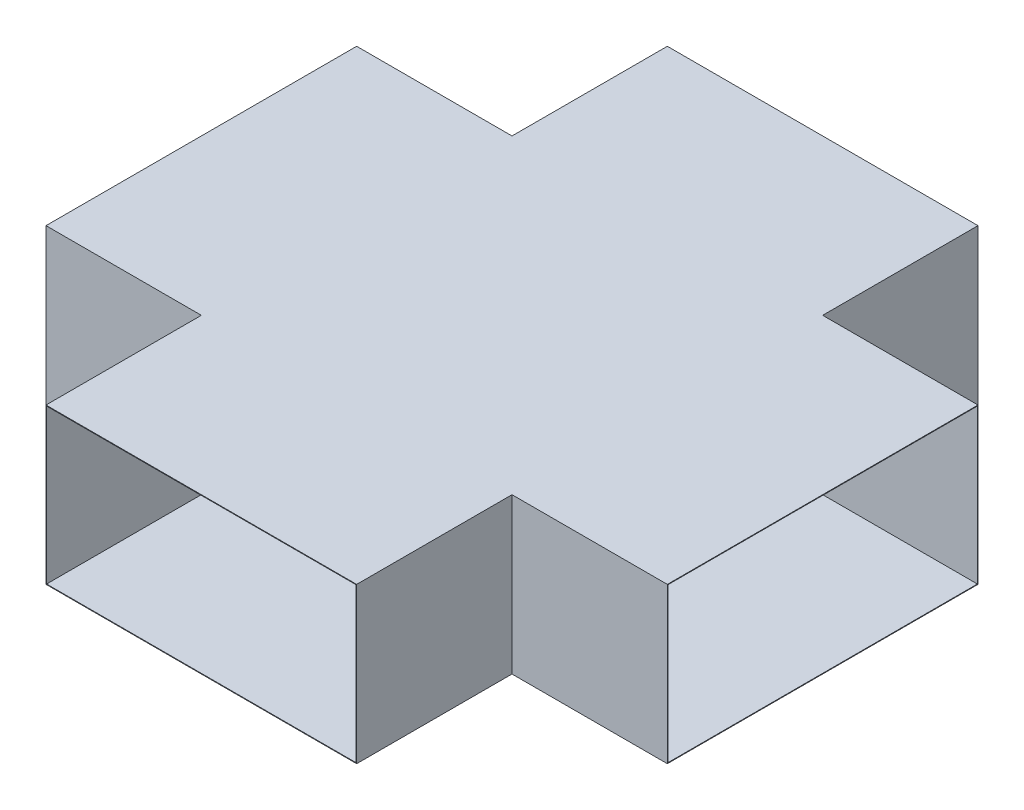
ISO-10303-21;
HEADER;
FILE_DESCRIPTION(('STEP AP214'),'2;1');
FILE_NAME('part.step','',(''),(''),'','','');
FILE_SCHEMA(('AUTOMOTIVE_DESIGN { 1 0 10303 214 1 1 1 1 }'));
ENDSEC;
DATA;
#1=APPLICATION_CONTEXT('core data for automotive mechanical design processes');
#2=APPLICATION_PROTOCOL_DEFINITION('international standard','automotive_design',2000,#1);
#3=PRODUCT_CONTEXT('',#1,'mechanical');
#4=PRODUCT('Part','Part','',(#3));
#5=PRODUCT_RELATED_PRODUCT_CATEGORY('part','',(#4));
#6=PRODUCT_DEFINITION_FORMATION('','',#4);
#7=PRODUCT_DEFINITION_CONTEXT('part definition',#1,'design');
#8=PRODUCT_DEFINITION('design','',#6,#7);
#9=PRODUCT_DEFINITION_SHAPE('','',#8);
#10=(LENGTH_UNIT() NAMED_UNIT(*) SI_UNIT(.MILLI.,.METRE.));
#11=(NAMED_UNIT(*) PLANE_ANGLE_UNIT() SI_UNIT($,.RADIAN.));
#12=(NAMED_UNIT(*) SI_UNIT($,.STERADIAN.) SOLID_ANGLE_UNIT());
#13=UNCERTAINTY_MEASURE_WITH_UNIT(LENGTH_MEASURE(1.E-05),#10,'distance_accuracy_value','');
#14=(GEOMETRIC_REPRESENTATION_CONTEXT(3) GLOBAL_UNCERTAINTY_ASSIGNED_CONTEXT((#13)) GLOBAL_UNIT_ASSIGNED_CONTEXT((#10,
#11,#12)) REPRESENTATION_CONTEXT('',''));
#15=CARTESIAN_POINT('',(0.,0.,0.));
#16=DIRECTION('',(0.,0.,1.));
#17=DIRECTION('',(1.,0.,0.));
#18=AXIS2_PLACEMENT_3D('',#15,#16,#17);
#19=CARTESIAN_POINT('',(1000.,250.,-498.));
#20=DIRECTION('',(0.,0.,1.));
#21=DIRECTION('',(0.,-1.,0.));
#22=AXIS2_PLACEMENT_3D('',#19,#20,#21);
#23=PLANE('',#22);
#24=DIRECTION('',(0.,-1.,0.));
#25=VECTOR('',#24,1.);
#26=CARTESIAN_POINT('',(498.,248.,-498.));
#27=LINE('',#26,#25);
#28=CARTESIAN_POINT('',(498.,248.,-498.));
#29=VERTEX_POINT('',#28);
#30=CARTESIAN_POINT('',(498.,-248.,-498.));
#31=VERTEX_POINT('',#30);
#32=EDGE_CURVE('E271',#29,#31,#27,.T.);
#33=ORIENTED_EDGE('',*,*,#32,.T.);
#34=DIRECTION('',(-1.,0.,0.));
#35=VECTOR('',#34,1.);
#36=CARTESIAN_POINT('',(1000.,-248.,-498.));
#37=LINE('',#36,#35);
#38=CARTESIAN_POINT('',(1000.,-248.,-498.));
#39=VERTEX_POINT('',#38);
#40=EDGE_CURVE('E283',#39,#31,#37,.T.);
#41=ORIENTED_EDGE('',*,*,#40,.F.);
#42=DIRECTION('',(0.,1.,0.));
#43=VECTOR('',#42,1.);
#44=CARTESIAN_POINT('',(1000.,250.,-498.));
#45=LINE('',#44,#43);
#46=CARTESIAN_POINT('',(1000.,248.,-498.));
#47=VERTEX_POINT('',#46);
#48=EDGE_CURVE('E506',#39,#47,#45,.T.);
#49=ORIENTED_EDGE('',*,*,#48,.T.);
#50=DIRECTION('',(-1.,0.,0.));
#51=VECTOR('',#50,1.);
#52=CARTESIAN_POINT('',(1000.,248.,-498.));
#53=LINE('',#52,#51);
#54=EDGE_CURVE('E285',#47,#29,#53,.T.);
#55=ORIENTED_EDGE('',*,*,#54,.T.);
#56=EDGE_LOOP('',(#33,#41,#49,#55));
#57=FACE_BOUND('',#56,.T.);
#58=ADVANCED_FACE('F106',(#57),#23,.T.);
#59=CARTESIAN_POINT('',(1000.,250.,-500.));
#60=DIRECTION('',(0.,0.,1.));
#61=DIRECTION('',(0.,-1.,0.));
#62=AXIS2_PLACEMENT_3D('',#59,#60,#61);
#63=PLANE('',#62);
#64=DIRECTION('',(0.,1.,0.));
#65=VECTOR('',#64,1.);
#66=CARTESIAN_POINT('',(-500.,-250.,-500.));
#67=LINE('',#66,#65);
#68=CARTESIAN_POINT('',(-500.,-250.,-500.));
#69=VERTEX_POINT('',#68);
#70=CARTESIAN_POINT('',(-500.,250.,-500.));
#71=VERTEX_POINT('',#70);
#72=EDGE_CURVE('E131',#69,#71,#67,.T.);
#73=ORIENTED_EDGE('',*,*,#72,.F.);
#74=DIRECTION('',(-1.,0.,0.));
#75=VECTOR('',#74,1.);
#76=CARTESIAN_POINT('',(1000.,-250.,-500.));
#77=LINE('',#76,#75);
#78=CARTESIAN_POINT('',(-1000.,-250.,-500.));
#79=VERTEX_POINT('',#78);
#80=EDGE_CURVE('E343',#69,#79,#77,.T.);
#81=ORIENTED_EDGE('',*,*,#80,.T.);
#82=DIRECTION('',(0.,1.,0.));
#83=VECTOR('',#82,1.);
#84=CARTESIAN_POINT('',(-1000.,250.,-500.));
#85=LINE('',#84,#83);
#86=CARTESIAN_POINT('',(-1000.,250.,-500.));
#87=VERTEX_POINT('',#86);
#88=EDGE_CURVE('E319',#79,#87,#85,.T.);
#89=ORIENTED_EDGE('',*,*,#88,.T.);
#90=DIRECTION('',(-1.,0.,0.));
#91=VECTOR('',#90,1.);
#92=CARTESIAN_POINT('',(1000.,250.,-500.));
#93=LINE('',#92,#91);
#94=EDGE_CURVE('E335',#71,#87,#93,.T.);
#95=ORIENTED_EDGE('',*,*,#94,.F.);
#96=EDGE_LOOP('',(#73,#81,#89,#95));
#97=FACE_BOUND('',#96,.T.);
#98=ADVANCED_FACE('F530',(#97),#63,.F.);
#99=DIRECTION('',(0.,-1.,0.));
#100=VECTOR('',#99,1.);
#101=CARTESIAN_POINT('',(500.,-250.,-500.));
#102=LINE('',#101,#100);
#103=CARTESIAN_POINT('',(500.,250.,-500.));
#104=VERTEX_POINT('',#103);
#105=CARTESIAN_POINT('',(500.,-250.,-500.));
#106=VERTEX_POINT('',#105);
#107=EDGE_CURVE('E429',#104,#106,#102,.T.);
#108=ORIENTED_EDGE('',*,*,#107,.F.);
#109=CARTESIAN_POINT('',(1000.,250.,-500.));
#110=VERTEX_POINT('',#109);
#111=EDGE_CURVE('E348',#110,#104,#93,.T.);
#112=ORIENTED_EDGE('',*,*,#111,.F.);
#113=DIRECTION('',(0.,1.,0.));
#114=VECTOR('',#113,1.);
#115=CARTESIAN_POINT('',(1000.,250.,-500.));
#116=LINE('',#115,#114);
#117=CARTESIAN_POINT('',(1000.,-250.,-500.));
#118=VERTEX_POINT('',#117);
#119=EDGE_CURVE('E309',#118,#110,#116,.T.);
#120=ORIENTED_EDGE('',*,*,#119,.F.);
#121=EDGE_CURVE('E337',#118,#106,#77,.T.);
#122=ORIENTED_EDGE('',*,*,#121,.T.);
#123=EDGE_LOOP('',(#108,#112,#120,#122));
#124=FACE_BOUND('',#123,.T.);
#125=ADVANCED_FACE('F535',(#124),#63,.F.);
#126=CARTESIAN_POINT('',(1000.,250.,498.));
#127=DIRECTION('',(0.,0.,-1.));
#128=DIRECTION('',(0.,1.,0.));
#129=AXIS2_PLACEMENT_3D('',#126,#127,#128);
#130=PLANE('',#129);
#131=DIRECTION('',(-1.,0.,0.));
#132=VECTOR('',#131,1.);
#133=CARTESIAN_POINT('',(1000.,-248.,498.));
#134=LINE('',#133,#132);
#135=CARTESIAN_POINT('',(1000.,-248.,498.));
#136=VERTEX_POINT('',#135);
#137=CARTESIAN_POINT('',(498.,-248.,498.));
#138=VERTEX_POINT('',#137);
#139=EDGE_CURVE('E296',#136,#138,#134,.T.);
#140=ORIENTED_EDGE('',*,*,#139,.T.);
#141=DIRECTION('',(0.,-1.,0.));
#142=VECTOR('',#141,1.);
#143=CARTESIAN_POINT('',(498.,248.,498.));
#144=LINE('',#143,#142);
#145=CARTESIAN_POINT('',(498.,248.,498.));
#146=VERTEX_POINT('',#145);
#147=EDGE_CURVE('E418',#146,#138,#144,.T.);
#148=ORIENTED_EDGE('',*,*,#147,.F.);
#149=DIRECTION('',(-1.,0.,0.));
#150=VECTOR('',#149,1.);
#151=CARTESIAN_POINT('',(1000.,248.,498.));
#152=LINE('',#151,#150);
#153=CARTESIAN_POINT('',(1000.,248.,498.));
#154=VERTEX_POINT('',#153);
#155=EDGE_CURVE('E490',#154,#146,#152,.T.);
#156=ORIENTED_EDGE('',*,*,#155,.F.);
#157=DIRECTION('',(0.,-1.,0.));
#158=VECTOR('',#157,1.);
#159=CARTESIAN_POINT('',(1000.,250.,498.));
#160=LINE('',#159,#158);
#161=EDGE_CURVE('E372',#154,#136,#160,.T.);
#162=ORIENTED_EDGE('',*,*,#161,.T.);
#163=EDGE_LOOP('',(#140,#148,#156,#162));
#164=FACE_BOUND('',#163,.T.);
#165=ADVANCED_FACE('F509',(#164),#130,.T.);
#166=CARTESIAN_POINT('',(-498.,248.,498.));
#167=VERTEX_POINT('',#166);
#168=CARTESIAN_POINT('',(-1000.,248.,498.));
#169=VERTEX_POINT('',#168);
#170=EDGE_CURVE('E492',#167,#169,#152,.T.);
#171=ORIENTED_EDGE('',*,*,#170,.F.);
#172=DIRECTION('',(0.,1.,0.));
#173=VECTOR('',#172,1.);
#174=CARTESIAN_POINT('',(-498.,-248.,498.));
#175=LINE('',#174,#173);
#176=CARTESIAN_POINT('',(-498.,-248.,498.));
#177=VERTEX_POINT('',#176);
#178=EDGE_CURVE('E419',#177,#167,#175,.T.);
#179=ORIENTED_EDGE('',*,*,#178,.F.);
#180=CARTESIAN_POINT('',(-1000.,-248.,498.));
#181=VERTEX_POINT('',#180);
#182=EDGE_CURVE('E293',#177,#181,#134,.T.);
#183=ORIENTED_EDGE('',*,*,#182,.T.);
#184=DIRECTION('',(0.,-1.,0.));
#185=VECTOR('',#184,1.);
#186=CARTESIAN_POINT('',(-1000.,250.,498.));
#187=LINE('',#186,#185);
#188=EDGE_CURVE('E355',#169,#181,#187,.T.);
#189=ORIENTED_EDGE('',*,*,#188,.F.);
#190=EDGE_LOOP('',(#171,#179,#183,#189));
#191=FACE_BOUND('',#190,.T.);
#192=ADVANCED_FACE('F526',(#191),#130,.T.);
#193=CARTESIAN_POINT('',(1000.,250.,500.));
#194=DIRECTION('',(0.,0.,-1.));
#195=DIRECTION('',(0.,1.,0.));
#196=AXIS2_PLACEMENT_3D('',#193,#194,#195);
#197=PLANE('',#196);
#198=DIRECTION('',(-1.,0.,0.));
#199=VECTOR('',#198,1.);
#200=CARTESIAN_POINT('',(1000.,-250.,500.));
#201=LINE('',#200,#199);
#202=CARTESIAN_POINT('',(-500.,-250.,500.));
#203=VERTEX_POINT('',#202);
#204=CARTESIAN_POINT('',(-1000.,-250.,500.));
#205=VERTEX_POINT('',#204);
#206=EDGE_CURVE('E115',#203,#205,#201,.T.);
#207=ORIENTED_EDGE('',*,*,#206,.F.);
#208=DIRECTION('',(0.,1.,0.));
#209=VECTOR('',#208,1.);
#210=CARTESIAN_POINT('',(-500.,-250.,500.));
#211=LINE('',#210,#209);
#212=CARTESIAN_POINT('',(-499.999999999999,250.,500.));
#213=VERTEX_POINT('',#212);
#214=EDGE_CURVE('E357',#203,#213,#211,.T.);
#215=ORIENTED_EDGE('',*,*,#214,.T.);
#216=DIRECTION('',(-1.,0.,0.));
#217=VECTOR('',#216,1.);
#218=CARTESIAN_POINT('',(1000.,250.,500.));
#219=LINE('',#218,#217);
#220=CARTESIAN_POINT('',(-1000.,250.,500.));
#221=VERTEX_POINT('',#220);
#222=EDGE_CURVE('E313',#213,#221,#219,.T.);
#223=ORIENTED_EDGE('',*,*,#222,.T.);
#224=DIRECTION('',(0.,-1.,0.));
#225=VECTOR('',#224,1.);
#226=CARTESIAN_POINT('',(-1000.,250.,500.));
#227=LINE('',#226,#225);
#228=EDGE_CURVE('E302',#221,#205,#227,.T.);
#229=ORIENTED_EDGE('',*,*,#228,.T.);
#230=EDGE_LOOP('',(#207,#215,#223,#229));
#231=FACE_BOUND('',#230,.T.);
#232=ADVANCED_FACE('F517',(#231),#197,.F.);
#233=CARTESIAN_POINT('',(1000.,0.,0.));
#234=DIRECTION('',(1.,0.,0.));
#235=DIRECTION('',(0.,0.,-1.));
#236=AXIS2_PLACEMENT_3D('',#233,#234,#235);
#237=PLANE('',#236);
#238=DIRECTION('',(0.,-1.,0.));
#239=VECTOR('',#238,1.);
#240=CARTESIAN_POINT('',(1000.,250.,500.));
#241=LINE('',#240,#239);
#242=CARTESIAN_POINT('',(1000.,250.,500.));
#243=VERTEX_POINT('',#242);
#244=CARTESIAN_POINT('',(1000.,-250.,500.));
#245=VERTEX_POINT('',#244);
#246=EDGE_CURVE('E303',#243,#245,#241,.T.);
#247=ORIENTED_EDGE('',*,*,#246,.T.);
#248=DIRECTION('',(0.,0.,-1.));
#249=VECTOR('',#248,1.);
#250=CARTESIAN_POINT('',(1000.,-250.,500.));
#251=LINE('',#250,#249);
#252=EDGE_CURVE('E306',#245,#118,#251,.T.);
#253=ORIENTED_EDGE('',*,*,#252,.T.);
#254=ORIENTED_EDGE('',*,*,#119,.T.);
#255=DIRECTION('',(0.,0.,1.));
#256=VECTOR('',#255,1.);
#257=CARTESIAN_POINT('',(1000.,250.,500.));
#258=LINE('',#257,#256);
#259=EDGE_CURVE('E311',#110,#243,#258,.T.);
#260=ORIENTED_EDGE('',*,*,#259,.T.);
#261=EDGE_LOOP('',(#247,#253,#254,#260));
#262=FACE_BOUND('',#261,.T.);
#263=DIRECTION('',(0.,0.,-1.));
#264=VECTOR('',#263,1.);
#265=CARTESIAN_POINT('',(1000.,-248.,500.));
#266=LINE('',#265,#264);
#267=EDGE_CURVE('E292',#136,#39,#266,.T.);
#268=ORIENTED_EDGE('',*,*,#267,.F.);
#269=ORIENTED_EDGE('',*,*,#161,.F.);
#270=DIRECTION('',(0.,0.,1.));
#271=VECTOR('',#270,1.);
#272=CARTESIAN_POINT('',(1000.,248.,500.));
#273=LINE('',#272,#271);
#274=EDGE_CURVE('E495',#47,#154,#273,.T.);
#275=ORIENTED_EDGE('',*,*,#274,.F.);
#276=ORIENTED_EDGE('',*,*,#48,.F.);
#277=EDGE_LOOP('',(#268,#269,#275,#276));
#278=FACE_BOUND('',#277,.T.);
#279=ADVANCED_FACE('F514',(#262,#278),#237,.T.);
#280=CARTESIAN_POINT('',(-1000.,0.,0.));
#281=DIRECTION('',(1.,0.,0.));
#282=DIRECTION('',(0.,0.,-1.));
#283=AXIS2_PLACEMENT_3D('',#280,#281,#282);
#284=PLANE('',#283);
#285=ORIENTED_EDGE('',*,*,#228,.F.);
#286=DIRECTION('',(0.,0.,1.));
#287=VECTOR('',#286,1.);
#288=CARTESIAN_POINT('',(-1000.,250.,500.));
#289=LINE('',#288,#287);
#290=EDGE_CURVE('E307',#87,#221,#289,.T.);
#291=ORIENTED_EDGE('',*,*,#290,.F.);
#292=ORIENTED_EDGE('',*,*,#88,.F.);
#293=DIRECTION('',(0.,0.,-1.));
#294=VECTOR('',#293,1.);
#295=CARTESIAN_POINT('',(-1000.,-250.,500.));
#296=LINE('',#295,#294);
#297=EDGE_CURVE('E316',#205,#79,#296,.T.);
#298=ORIENTED_EDGE('',*,*,#297,.F.);
#299=EDGE_LOOP('',(#285,#291,#292,#298));
#300=FACE_BOUND('',#299,.T.);
#301=ORIENTED_EDGE('',*,*,#188,.T.);
#302=DIRECTION('',(0.,0.,-1.));
#303=VECTOR('',#302,1.);
#304=CARTESIAN_POINT('',(-1000.,-248.,500.));
#305=LINE('',#304,#303);
#306=CARTESIAN_POINT('',(-1000.,-248.,-498.));
#307=VERTEX_POINT('',#306);
#308=EDGE_CURVE('E500',#181,#307,#305,.T.);
#309=ORIENTED_EDGE('',*,*,#308,.T.);
#310=DIRECTION('',(0.,1.,0.));
#311=VECTOR('',#310,1.);
#312=CARTESIAN_POINT('',(-1000.,250.,-498.));
#313=LINE('',#312,#311);
#314=CARTESIAN_POINT('',(-1000.,248.,-498.));
#315=VERTEX_POINT('',#314);
#316=EDGE_CURVE('E498',#307,#315,#313,.T.);
#317=ORIENTED_EDGE('',*,*,#316,.T.);
#318=DIRECTION('',(0.,0.,1.));
#319=VECTOR('',#318,1.);
#320=CARTESIAN_POINT('',(-1000.,248.,500.));
#321=LINE('',#320,#319);
#322=EDGE_CURVE('E488',#315,#169,#321,.T.);
#323=ORIENTED_EDGE('',*,*,#322,.T.);
#324=EDGE_LOOP('',(#301,#309,#317,#323));
#325=FACE_BOUND('',#324,.T.);
#326=ADVANCED_FACE('F516',(#300,#325),#284,.F.);
#327=CARTESIAN_POINT('',(500.,250.,500.));
#328=VERTEX_POINT('',#327);
#329=EDGE_CURVE('E332',#243,#328,#219,.T.);
#330=ORIENTED_EDGE('',*,*,#329,.T.);
#331=DIRECTION('',(0.,-1.,0.));
#332=VECTOR('',#331,1.);
#333=CARTESIAN_POINT('',(500.,-250.,500.));
#334=LINE('',#333,#332);
#335=CARTESIAN_POINT('',(500.,-250.,500.));
#336=VERTEX_POINT('',#335);
#337=EDGE_CURVE('E361',#328,#336,#334,.T.);
#338=ORIENTED_EDGE('',*,*,#337,.T.);
#339=EDGE_CURVE('E12',#245,#336,#201,.T.);
#340=ORIENTED_EDGE('',*,*,#339,.F.);
#341=ORIENTED_EDGE('',*,*,#246,.F.);
#342=EDGE_LOOP('',(#330,#338,#340,#341));
#343=FACE_BOUND('',#342,.T.);
#344=ADVANCED_FACE('F108',(#343),#197,.F.);
#345=CARTESIAN_POINT('',(1000.,-250.,500.));
#346=DIRECTION('',(0.,1.,0.));
#347=DIRECTION('',(0.,0.,1.));
#348=AXIS2_PLACEMENT_3D('',#345,#346,#347);
#349=PLANE('',#348);
#350=ORIENTED_EDGE('',*,*,#297,.T.);
#351=ORIENTED_EDGE('',*,*,#80,.F.);
#352=DIRECTION('',(0.,0.,1.));
#353=VECTOR('',#352,1.);
#354=CARTESIAN_POINT('',(-500.,-250.,-1000.));
#355=LINE('',#354,#353);
#356=CARTESIAN_POINT('',(-500.,-250.,-1000.));
#357=VERTEX_POINT('',#356);
#358=EDGE_CURVE('E437',#357,#69,#355,.T.);
#359=ORIENTED_EDGE('',*,*,#358,.F.);
#360=DIRECTION('',(-1.,0.,0.));
#361=VECTOR('',#360,1.);
#362=CARTESIAN_POINT('',(-500.,-250.,-1000.));
#363=LINE('',#362,#361);
#364=CARTESIAN_POINT('',(500.,-250.,-1000.));
#365=VERTEX_POINT('',#364);
#366=EDGE_CURVE('E458',#365,#357,#363,.T.);
#367=ORIENTED_EDGE('',*,*,#366,.F.);
#368=DIRECTION('',(0.,0.,1.));
#369=VECTOR('',#368,1.);
#370=CARTESIAN_POINT('',(500.,-250.,-1000.));
#371=LINE('',#370,#369);
#372=EDGE_CURVE('E433',#365,#106,#371,.T.);
#373=ORIENTED_EDGE('',*,*,#372,.T.);
#374=ORIENTED_EDGE('',*,*,#121,.F.);
#375=ORIENTED_EDGE('',*,*,#252,.F.);
#376=ORIENTED_EDGE('',*,*,#339,.T.);
#377=DIRECTION('',(0.,0.,-1.));
#378=VECTOR('',#377,1.);
#379=CARTESIAN_POINT('',(500.,-250.,1000.));
#380=LINE('',#379,#378);
#381=CARTESIAN_POINT('',(500.,-250.,1000.));
#382=VERTEX_POINT('',#381);
#383=EDGE_CURVE('E356',#382,#336,#380,.T.);
#384=ORIENTED_EDGE('',*,*,#383,.F.);
#385=DIRECTION('',(-1.,0.,0.));
#386=VECTOR('',#385,1.);
#387=CARTESIAN_POINT('',(-500.,-250.,1000.));
#388=LINE('',#387,#386);
#389=CARTESIAN_POINT('',(-500.,-250.,1000.));
#390=VERTEX_POINT('',#389);
#391=EDGE_CURVE('E368',#382,#390,#388,.T.);
#392=ORIENTED_EDGE('',*,*,#391,.T.);
#393=DIRECTION('',(0.,0.,-1.));
#394=VECTOR('',#393,1.);
#395=CARTESIAN_POINT('',(-500.,-250.,1000.));
#396=LINE('',#395,#394);
#397=EDGE_CURVE('E353',#390,#203,#396,.T.);
#398=ORIENTED_EDGE('',*,*,#397,.T.);
#399=ORIENTED_EDGE('',*,*,#206,.T.);
#400=EDGE_LOOP('',(#350,#351,#359,#367,#373,#374,#375,#376,#384,#392,#398,#399));
#401=FACE_BOUND('',#400,.T.);
#402=ADVANCED_FACE('F549',(#401),#349,.F.);
#403=CARTESIAN_POINT('',(1000.,250.,500.));
#404=DIRECTION('',(0.,-1.,0.));
#405=DIRECTION('',(0.,0.,-1.));
#406=AXIS2_PLACEMENT_3D('',#403,#404,#405);
#407=PLANE('',#406);
#408=ORIENTED_EDGE('',*,*,#290,.T.);
#409=ORIENTED_EDGE('',*,*,#222,.F.);
#410=DIRECTION('',(0.,0.,-1.));
#411=VECTOR('',#410,1.);
#412=CARTESIAN_POINT('',(-499.999999999999,250.,1000.));
#413=LINE('',#412,#411);
#414=CARTESIAN_POINT('',(-499.999999999999,250.,1000.));
#415=VERTEX_POINT('',#414);
#416=EDGE_CURVE('E382',#415,#213,#413,.T.);
#417=ORIENTED_EDGE('',*,*,#416,.F.);
#418=DIRECTION('',(1.,0.,0.));
#419=VECTOR('',#418,1.);
#420=CARTESIAN_POINT('',(-499.999999999999,250.,1000.));
#421=LINE('',#420,#419);
#422=CARTESIAN_POINT('',(500.,250.,1000.));
#423=VERTEX_POINT('',#422);
#424=EDGE_CURVE('E392',#415,#423,#421,.T.);
#425=ORIENTED_EDGE('',*,*,#424,.T.);
#426=DIRECTION('',(0.,0.,-1.));
#427=VECTOR('',#426,1.);
#428=CARTESIAN_POINT('',(500.,250.,1000.));
#429=LINE('',#428,#427);
#430=EDGE_CURVE('E378',#423,#328,#429,.T.);
#431=ORIENTED_EDGE('',*,*,#430,.T.);
#432=ORIENTED_EDGE('',*,*,#329,.F.);
#433=ORIENTED_EDGE('',*,*,#259,.F.);
#434=ORIENTED_EDGE('',*,*,#111,.T.);
#435=DIRECTION('',(0.,0.,1.));
#436=VECTOR('',#435,1.);
#437=CARTESIAN_POINT('',(500.,250.,-1000.));
#438=LINE('',#437,#436);
#439=CARTESIAN_POINT('',(500.,250.,-1000.));
#440=VERTEX_POINT('',#439);
#441=EDGE_CURVE('E436',#440,#104,#438,.T.);
#442=ORIENTED_EDGE('',*,*,#441,.F.);
#443=DIRECTION('',(1.,0.,0.));
#444=VECTOR('',#443,1.);
#445=CARTESIAN_POINT('',(-499.999999999999,250.,-1000.));
#446=LINE('',#445,#444);
#447=CARTESIAN_POINT('',(-499.999999999999,250.,-1000.));
#448=VERTEX_POINT('',#447);
#449=EDGE_CURVE('E450',#448,#440,#446,.T.);
#450=ORIENTED_EDGE('',*,*,#449,.F.);
#451=DIRECTION('',(0.,0.,1.));
#452=VECTOR('',#451,1.);
#453=CARTESIAN_POINT('',(-499.999999999999,250.,-1000.));
#454=LINE('',#453,#452);
#455=EDGE_CURVE('E422',#448,#71,#454,.T.);
#456=ORIENTED_EDGE('',*,*,#455,.T.);
#457=ORIENTED_EDGE('',*,*,#94,.T.);
#458=EDGE_LOOP('',(#408,#409,#417,#425,#431,#432,#433,#434,#442,#450,#456,#457));
#459=FACE_BOUND('',#458,.T.);
#460=ADVANCED_FACE('F545',(#459),#407,.F.);
#461=CARTESIAN_POINT('',(1000.,-248.,500.));
#462=DIRECTION('',(0.,1.,0.));
#463=DIRECTION('',(0.,0.,1.));
#464=AXIS2_PLACEMENT_3D('',#461,#462,#463);
#465=PLANE('',#464);
#466=ORIENTED_EDGE('',*,*,#308,.F.);
#467=ORIENTED_EDGE('',*,*,#182,.F.);
#468=DIRECTION('',(0.,0.,-1.));
#469=VECTOR('',#468,1.);
#470=CARTESIAN_POINT('',(-498.,-248.,1000.));
#471=LINE('',#470,#469);
#472=CARTESIAN_POINT('',(-498.,-248.,1000.));
#473=VERTEX_POINT('',#472);
#474=EDGE_CURVE('E362',#473,#177,#471,.T.);
#475=ORIENTED_EDGE('',*,*,#474,.F.);
#476=DIRECTION('',(-1.,0.,0.));
#477=VECTOR('',#476,1.);
#478=CARTESIAN_POINT('',(-500.,-248.,1000.));
#479=LINE('',#478,#477);
#480=CARTESIAN_POINT('',(498.,-248.,1000.));
#481=VERTEX_POINT('',#480);
#482=EDGE_CURVE('E402',#481,#473,#479,.T.);
#483=ORIENTED_EDGE('',*,*,#482,.F.);
#484=DIRECTION('',(0.,0.,-1.));
#485=VECTOR('',#484,1.);
#486=CARTESIAN_POINT('',(498.,-248.,1000.));
#487=LINE('',#486,#485);
#488=EDGE_CURVE('E404',#481,#138,#487,.T.);
#489=ORIENTED_EDGE('',*,*,#488,.T.);
#490=ORIENTED_EDGE('',*,*,#139,.F.);
#491=ORIENTED_EDGE('',*,*,#267,.T.);
#492=ORIENTED_EDGE('',*,*,#40,.T.);
#493=DIRECTION('',(0.,0.,1.));
#494=VECTOR('',#493,1.);
#495=CARTESIAN_POINT('',(498.,-248.,-1000.));
#496=LINE('',#495,#494);
#497=CARTESIAN_POINT('',(498.,-248.,-1000.));
#498=VERTEX_POINT('',#497);
#499=EDGE_CURVE('E268',#498,#31,#496,.T.);
#500=ORIENTED_EDGE('',*,*,#499,.F.);
#501=DIRECTION('',(-1.,0.,0.));
#502=VECTOR('',#501,1.);
#503=CARTESIAN_POINT('',(-500.,-248.,-1000.));
#504=LINE('',#503,#502);
#505=CARTESIAN_POINT('',(-498.,-248.,-1000.));
#506=VERTEX_POINT('',#505);
#507=EDGE_CURVE('E469',#498,#506,#504,.T.);
#508=ORIENTED_EDGE('',*,*,#507,.T.);
#509=DIRECTION('',(0.,0.,1.));
#510=VECTOR('',#509,1.);
#511=CARTESIAN_POINT('',(-498.,-248.,-1000.));
#512=LINE('',#511,#510);
#513=CARTESIAN_POINT('',(-498.,-248.,-498.));
#514=VERTEX_POINT('',#513);
#515=EDGE_CURVE('E278',#506,#514,#512,.T.);
#516=ORIENTED_EDGE('',*,*,#515,.T.);
#517=EDGE_CURVE('E294',#514,#307,#37,.T.);
#518=ORIENTED_EDGE('',*,*,#517,.T.);
#519=EDGE_LOOP('',(#466,#467,#475,#483,#489,#490,#491,#492,#500,#508,#516,#518));
#520=FACE_BOUND('',#519,.T.);
#521=ADVANCED_FACE('F289',(#520),#465,.T.);
#522=DIRECTION('',(0.,1.,0.));
#523=VECTOR('',#522,1.);
#524=CARTESIAN_POINT('',(-498.,-248.,-498.));
#525=LINE('',#524,#523);
#526=CARTESIAN_POINT('',(-497.999999999999,248.,-498.));
#527=VERTEX_POINT('',#526);
#528=EDGE_CURVE('E286',#514,#527,#525,.T.);
#529=ORIENTED_EDGE('',*,*,#528,.T.);
#530=EDGE_CURVE('E480',#527,#315,#53,.T.);
#531=ORIENTED_EDGE('',*,*,#530,.T.);
#532=ORIENTED_EDGE('',*,*,#316,.F.);
#533=ORIENTED_EDGE('',*,*,#517,.F.);
#534=EDGE_LOOP('',(#529,#531,#532,#533));
#535=FACE_BOUND('',#534,.T.);
#536=ADVANCED_FACE('F478',(#535),#23,.T.);
#537=CARTESIAN_POINT('',(1000.,248.,500.));
#538=DIRECTION('',(0.,-1.,0.));
#539=DIRECTION('',(0.,0.,-1.));
#540=AXIS2_PLACEMENT_3D('',#537,#538,#539);
#541=PLANE('',#540);
#542=ORIENTED_EDGE('',*,*,#322,.F.);
#543=ORIENTED_EDGE('',*,*,#530,.F.);
#544=DIRECTION('',(0.,0.,1.));
#545=VECTOR('',#544,1.);
#546=CARTESIAN_POINT('',(-497.999999999999,248.,-1000.));
#547=LINE('',#546,#545);
#548=CARTESIAN_POINT('',(-497.999999999999,248.,-1000.));
#549=VERTEX_POINT('',#548);
#550=EDGE_CURVE('E448',#549,#527,#547,.T.);
#551=ORIENTED_EDGE('',*,*,#550,.F.);
#552=DIRECTION('',(1.,0.,0.));
#553=VECTOR('',#552,1.);
#554=CARTESIAN_POINT('',(-499.999999999999,248.,-1000.));
#555=LINE('',#554,#553);
#556=CARTESIAN_POINT('',(498.,248.,-1000.));
#557=VERTEX_POINT('',#556);
#558=EDGE_CURVE('E463',#549,#557,#555,.T.);
#559=ORIENTED_EDGE('',*,*,#558,.T.);
#560=DIRECTION('',(0.,0.,1.));
#561=VECTOR('',#560,1.);
#562=CARTESIAN_POINT('',(498.,248.,-1000.));
#563=LINE('',#562,#561);
#564=EDGE_CURVE('E123',#557,#29,#563,.T.);
#565=ORIENTED_EDGE('',*,*,#564,.T.);
#566=ORIENTED_EDGE('',*,*,#54,.F.);
#567=ORIENTED_EDGE('',*,*,#274,.T.);
#568=ORIENTED_EDGE('',*,*,#155,.T.);
#569=DIRECTION('',(0.,0.,-1.));
#570=VECTOR('',#569,1.);
#571=CARTESIAN_POINT('',(498.,248.,1000.));
#572=LINE('',#571,#570);
#573=CARTESIAN_POINT('',(498.,248.,1000.));
#574=VERTEX_POINT('',#573);
#575=EDGE_CURVE('E401',#574,#146,#572,.T.);
#576=ORIENTED_EDGE('',*,*,#575,.F.);
#577=DIRECTION('',(1.,0.,0.));
#578=VECTOR('',#577,1.);
#579=CARTESIAN_POINT('',(-499.999999999999,248.,1000.));
#580=LINE('',#579,#578);
#581=CARTESIAN_POINT('',(-497.999999999999,248.,1000.));
#582=VERTEX_POINT('',#581);
#583=EDGE_CURVE('E412',#582,#574,#580,.T.);
#584=ORIENTED_EDGE('',*,*,#583,.F.);
#585=DIRECTION('',(0.,0.,-1.));
#586=VECTOR('',#585,1.);
#587=CARTESIAN_POINT('',(-497.999999999999,248.,1000.));
#588=LINE('',#587,#586);
#589=EDGE_CURVE('E399',#582,#167,#588,.T.);
#590=ORIENTED_EDGE('',*,*,#589,.T.);
#591=ORIENTED_EDGE('',*,*,#170,.T.);
#592=EDGE_LOOP('',(#542,#543,#551,#559,#565,#566,#567,#568,#576,#584,#590,#591));
#593=FACE_BOUND('',#592,.T.);
#594=ADVANCED_FACE('F485',(#593),#541,.T.);
#595=CARTESIAN_POINT('',(-500.,-250.,1000.));
#596=DIRECTION('',(-1.,0.,0.));
#597=DIRECTION('',(0.,-1.,0.));
#598=AXIS2_PLACEMENT_3D('',#595,#596,#597);
#599=PLANE('',#598);
#600=ORIENTED_EDGE('',*,*,#214,.F.);
#601=ORIENTED_EDGE('',*,*,#397,.F.);
#602=DIRECTION('',(0.,1.,0.));
#603=VECTOR('',#602,1.);
#604=CARTESIAN_POINT('',(-500.,-250.,1000.));
#605=LINE('',#604,#603);
#606=EDGE_CURVE('E376',#390,#415,#605,.T.);
#607=ORIENTED_EDGE('',*,*,#606,.T.);
#608=ORIENTED_EDGE('',*,*,#416,.T.);
#609=EDGE_LOOP('',(#600,#601,#607,#608));
#610=FACE_BOUND('',#609,.T.);
#611=ADVANCED_FACE('F544',(#610),#599,.T.);
#612=CARTESIAN_POINT('',(500.,-250.,1000.));
#613=DIRECTION('',(1.,0.,0.));
#614=DIRECTION('',(0.,1.,0.));
#615=AXIS2_PLACEMENT_3D('',#612,#613,#614);
#616=PLANE('',#615);
#617=ORIENTED_EDGE('',*,*,#337,.F.);
#618=ORIENTED_EDGE('',*,*,#430,.F.);
#619=DIRECTION('',(0.,-1.,0.));
#620=VECTOR('',#619,1.);
#621=CARTESIAN_POINT('',(500.,-250.,1000.));
#622=LINE('',#621,#620);
#623=EDGE_CURVE('E388',#423,#382,#622,.T.);
#624=ORIENTED_EDGE('',*,*,#623,.T.);
#625=ORIENTED_EDGE('',*,*,#383,.T.);
#626=EDGE_LOOP('',(#617,#618,#624,#625));
#627=FACE_BOUND('',#626,.T.);
#628=ADVANCED_FACE('F598',(#627),#616,.T.);
#629=CARTESIAN_POINT('',(0.,0.,1000.));
#630=DIRECTION('',(0.,0.,-1.));
#631=DIRECTION('',(-1.,0.,0.));
#632=AXIS2_PLACEMENT_3D('',#629,#630,#631);
#633=PLANE('',#632);
#634=ORIENTED_EDGE('',*,*,#482,.T.);
#635=DIRECTION('',(0.,1.,0.));
#636=VECTOR('',#635,1.);
#637=CARTESIAN_POINT('',(-498.,-250.,1000.));
#638=LINE('',#637,#636);
#639=EDGE_CURVE('E415',#473,#582,#638,.T.);
#640=ORIENTED_EDGE('',*,*,#639,.T.);
#641=ORIENTED_EDGE('',*,*,#583,.T.);
#642=DIRECTION('',(0.,-1.,0.));
#643=VECTOR('',#642,1.);
#644=CARTESIAN_POINT('',(498.,-250.,1000.));
#645=LINE('',#644,#643);
#646=EDGE_CURVE('E409',#574,#481,#645,.T.);
#647=ORIENTED_EDGE('',*,*,#646,.T.);
#648=EDGE_LOOP('',(#634,#640,#641,#647));
#649=FACE_BOUND('',#648,.T.);
#650=ORIENTED_EDGE('',*,*,#606,.F.);
#651=ORIENTED_EDGE('',*,*,#391,.F.);
#652=ORIENTED_EDGE('',*,*,#623,.F.);
#653=ORIENTED_EDGE('',*,*,#424,.F.);
#654=EDGE_LOOP('',(#650,#651,#652,#653));
#655=FACE_BOUND('',#654,.T.);
#656=ADVANCED_FACE('F594',(#649,#655),#633,.F.);
#657=CARTESIAN_POINT('',(-498.,-250.,1000.));
#658=DIRECTION('',(-1.,0.,0.));
#659=DIRECTION('',(0.,-1.,0.));
#660=AXIS2_PLACEMENT_3D('',#657,#658,#659);
#661=PLANE('',#660);
#662=ORIENTED_EDGE('',*,*,#474,.T.);
#663=ORIENTED_EDGE('',*,*,#178,.T.);
#664=ORIENTED_EDGE('',*,*,#589,.F.);
#665=ORIENTED_EDGE('',*,*,#639,.F.);
#666=EDGE_LOOP('',(#662,#663,#664,#665));
#667=FACE_BOUND('',#666,.T.);
#668=ADVANCED_FACE('F590',(#667),#661,.F.);
#669=CARTESIAN_POINT('',(498.,-250.,1000.));
#670=DIRECTION('',(1.,0.,0.));
#671=DIRECTION('',(0.,1.,0.));
#672=AXIS2_PLACEMENT_3D('',#669,#670,#671);
#673=PLANE('',#672);
#674=ORIENTED_EDGE('',*,*,#575,.T.);
#675=ORIENTED_EDGE('',*,*,#147,.T.);
#676=ORIENTED_EDGE('',*,*,#488,.F.);
#677=ORIENTED_EDGE('',*,*,#646,.F.);
#678=EDGE_LOOP('',(#674,#675,#676,#677));
#679=FACE_BOUND('',#678,.T.);
#680=ADVANCED_FACE('F585',(#679),#673,.F.);
#681=CARTESIAN_POINT('',(0.,0.,-1000.));
#682=DIRECTION('',(0.,0.,1.));
#683=DIRECTION('',(1.,0.,0.));
#684=AXIS2_PLACEMENT_3D('',#681,#682,#683);
#685=PLANE('',#684);
#686=DIRECTION('',(0.,1.,0.));
#687=VECTOR('',#686,1.);
#688=CARTESIAN_POINT('',(-500.,-250.,-1000.));
#689=LINE('',#688,#687);
#690=EDGE_CURVE('E432',#357,#448,#689,.T.);
#691=ORIENTED_EDGE('',*,*,#690,.T.);
#692=ORIENTED_EDGE('',*,*,#449,.T.);
#693=DIRECTION('',(0.,-1.,0.));
#694=VECTOR('',#693,1.);
#695=CARTESIAN_POINT('',(500.,-250.,-1000.));
#696=LINE('',#695,#694);
#697=EDGE_CURVE('E454',#440,#365,#696,.T.);
#698=ORIENTED_EDGE('',*,*,#697,.T.);
#699=ORIENTED_EDGE('',*,*,#366,.T.);
#700=EDGE_LOOP('',(#691,#692,#698,#699));
#701=FACE_BOUND('',#700,.T.);
#702=DIRECTION('',(0.,1.,0.));
#703=VECTOR('',#702,1.);
#704=CARTESIAN_POINT('',(-498.,-250.,-1000.));
#705=LINE('',#704,#703);
#706=EDGE_CURVE('E471',#506,#549,#705,.T.);
#707=ORIENTED_EDGE('',*,*,#706,.F.);
#708=ORIENTED_EDGE('',*,*,#507,.F.);
#709=DIRECTION('',(0.,-1.,0.));
#710=VECTOR('',#709,1.);
#711=CARTESIAN_POINT('',(498.,-250.,-1000.));
#712=LINE('',#711,#710);
#713=EDGE_CURVE('E274',#557,#498,#712,.T.);
#714=ORIENTED_EDGE('',*,*,#713,.F.);
#715=ORIENTED_EDGE('',*,*,#558,.F.);
#716=EDGE_LOOP('',(#707,#708,#714,#715));
#717=FACE_BOUND('',#716,.T.);
#718=ADVANCED_FACE('F576',(#701,#717),#685,.F.);
#719=CARTESIAN_POINT('',(-500.,-250.,-1000.));
#720=DIRECTION('',(1.,0.,0.));
#721=DIRECTION('',(0.,1.,0.));
#722=AXIS2_PLACEMENT_3D('',#719,#720,#721);
#723=PLANE('',#722);
#724=ORIENTED_EDGE('',*,*,#72,.T.);
#725=ORIENTED_EDGE('',*,*,#455,.F.);
#726=ORIENTED_EDGE('',*,*,#690,.F.);
#727=ORIENTED_EDGE('',*,*,#358,.T.);
#728=EDGE_LOOP('',(#724,#725,#726,#727));
#729=FACE_BOUND('',#728,.T.);
#730=ADVANCED_FACE('F573',(#729),#723,.F.);
#731=CARTESIAN_POINT('',(500.,-250.,-1000.));
#732=DIRECTION('',(-1.,0.,0.));
#733=DIRECTION('',(0.,-1.,0.));
#734=AXIS2_PLACEMENT_3D('',#731,#732,#733);
#735=PLANE('',#734);
#736=ORIENTED_EDGE('',*,*,#107,.T.);
#737=ORIENTED_EDGE('',*,*,#372,.F.);
#738=ORIENTED_EDGE('',*,*,#697,.F.);
#739=ORIENTED_EDGE('',*,*,#441,.T.);
#740=EDGE_LOOP('',(#736,#737,#738,#739));
#741=FACE_BOUND('',#740,.T.);
#742=ADVANCED_FACE('F575',(#741),#735,.F.);
#743=CARTESIAN_POINT('',(-498.,-250.,-1000.));
#744=DIRECTION('',(1.,0.,0.));
#745=DIRECTION('',(0.,1.,0.));
#746=AXIS2_PLACEMENT_3D('',#743,#744,#745);
#747=PLANE('',#746);
#748=ORIENTED_EDGE('',*,*,#550,.T.);
#749=ORIENTED_EDGE('',*,*,#528,.F.);
#750=ORIENTED_EDGE('',*,*,#515,.F.);
#751=ORIENTED_EDGE('',*,*,#706,.T.);
#752=EDGE_LOOP('',(#748,#749,#750,#751));
#753=FACE_BOUND('',#752,.T.);
#754=ADVANCED_FACE('F582',(#753),#747,.T.);
#755=CARTESIAN_POINT('',(498.,-250.,-1000.));
#756=DIRECTION('',(-1.,0.,0.));
#757=DIRECTION('',(0.,-1.,0.));
#758=AXIS2_PLACEMENT_3D('',#755,#756,#757);
#759=PLANE('',#758);
#760=ORIENTED_EDGE('',*,*,#499,.T.);
#761=ORIENTED_EDGE('',*,*,#32,.F.);
#762=ORIENTED_EDGE('',*,*,#564,.F.);
#763=ORIENTED_EDGE('',*,*,#713,.T.);
#764=EDGE_LOOP('',(#760,#761,#762,#763));
#765=FACE_BOUND('',#764,.T.);
#766=ADVANCED_FACE('F270',(#765),#759,.T.);
#767=CLOSED_SHELL('',(#58,#98,#125,#165,#192,#232,#279,#326,#344,#402,#460,#521,#536,#594,#611,
#628,#656,#668,#680,#718,#730,#742,#754,#766));
#768=MANIFOLD_SOLID_BREP('B2',#767);
#769=ADVANCED_BREP_SHAPE_REPRESENTATION('',(#18,#768),#14);
#770=SHAPE_DEFINITION_REPRESENTATION(#9,#769);
ENDSEC;
END-ISO-10303-21;
